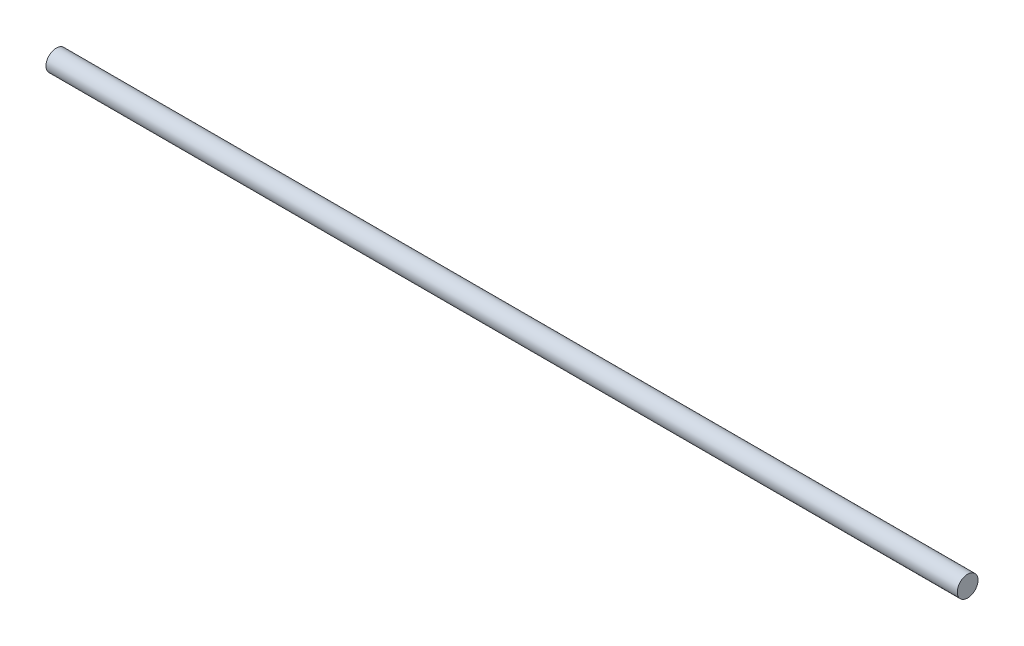
ISO-10303-21;
HEADER;
FILE_DESCRIPTION(('STEP AP214'),'2;1');
FILE_NAME('part.step','',(''),(''),'','','');
FILE_SCHEMA(('AUTOMOTIVE_DESIGN { 1 0 10303 214 1 1 1 1 }'));
ENDSEC;
DATA;
#1=APPLICATION_CONTEXT('core data for automotive mechanical design processes');
#2=APPLICATION_PROTOCOL_DEFINITION('international standard','automotive_design',2000,#1);
#3=PRODUCT_CONTEXT('',#1,'mechanical');
#4=PRODUCT('Part','Part','',(#3));
#5=PRODUCT_RELATED_PRODUCT_CATEGORY('part','',(#4));
#6=PRODUCT_DEFINITION_FORMATION('','',#4);
#7=PRODUCT_DEFINITION_CONTEXT('part definition',#1,'design');
#8=PRODUCT_DEFINITION('design','',#6,#7);
#9=PRODUCT_DEFINITION_SHAPE('','',#8);
#10=(LENGTH_UNIT() NAMED_UNIT(*) SI_UNIT(.MILLI.,.METRE.));
#11=(NAMED_UNIT(*) PLANE_ANGLE_UNIT() SI_UNIT($,.RADIAN.));
#12=(NAMED_UNIT(*) SI_UNIT($,.STERADIAN.) SOLID_ANGLE_UNIT());
#13=UNCERTAINTY_MEASURE_WITH_UNIT(LENGTH_MEASURE(1.E-05),#10,'distance_accuracy_value','');
#14=(GEOMETRIC_REPRESENTATION_CONTEXT(3) GLOBAL_UNCERTAINTY_ASSIGNED_CONTEXT((#13)) GLOBAL_UNIT_ASSIGNED_CONTEXT((#10,
#11,#12)) REPRESENTATION_CONTEXT('',''));
#15=CARTESIAN_POINT('',(0.,0.,0.));
#16=DIRECTION('',(0.,0.,1.));
#17=DIRECTION('',(1.,0.,0.));
#18=AXIS2_PLACEMENT_3D('',#15,#16,#17);
#19=CARTESIAN_POINT('',(220.,0.,0.));
#20=DIRECTION('',(-1.,0.,0.));
#21=DIRECTION('',(0.,0.,1.));
#22=AXIS2_PLACEMENT_3D('',#19,#20,#21);
#23=CYLINDRICAL_SURFACE('',#22,2.5);
#24=CARTESIAN_POINT('',(220.,0.,0.));
#25=DIRECTION('',(1.,0.,0.));
#26=DIRECTION('',(0.,0.,-1.));
#27=AXIS2_PLACEMENT_3D('',#24,#25,#26);
#28=CIRCLE('',#27,2.5);
#29=CARTESIAN_POINT('',(220.,0.,-2.5));
#30=VERTEX_POINT('',#29);
#31=EDGE_CURVE('E10',#30,#30,#28,.T.);
#32=ORIENTED_EDGE('',*,*,#31,.F.);
#33=EDGE_LOOP('',(#32));
#34=FACE_BOUND('',#33,.T.);
#35=CARTESIAN_POINT('',(0.,0.,0.));
#36=DIRECTION('',(1.,0.,0.));
#37=DIRECTION('',(0.,0.,-1.));
#38=AXIS2_PLACEMENT_3D('',#35,#36,#37);
#39=CIRCLE('',#38,2.5);
#40=CARTESIAN_POINT('',(0.,0.,-2.5));
#41=VERTEX_POINT('',#40);
#42=EDGE_CURVE('E34',#41,#41,#39,.T.);
#43=ORIENTED_EDGE('',*,*,#42,.T.);
#44=EDGE_LOOP('',(#43));
#45=FACE_BOUND('',#44,.T.);
#46=ADVANCED_FACE('F31',(#34,#45),#23,.T.);
#47=CARTESIAN_POINT('',(220.,0.,0.));
#48=DIRECTION('',(1.,0.,0.));
#49=DIRECTION('',(0.,0.,-1.));
#50=AXIS2_PLACEMENT_3D('',#47,#48,#49);
#51=PLANE('',#50);
#52=ORIENTED_EDGE('',*,*,#31,.T.);
#53=EDGE_LOOP('',(#52));
#54=FACE_BOUND('',#53,.T.);
#55=ADVANCED_FACE('F46',(#54),#51,.T.);
#56=CARTESIAN_POINT('',(0.,0.,0.));
#57=DIRECTION('',(1.,0.,0.));
#58=DIRECTION('',(0.,0.,-1.));
#59=AXIS2_PLACEMENT_3D('',#56,#57,#58);
#60=PLANE('',#59);
#61=ORIENTED_EDGE('',*,*,#42,.F.);
#62=EDGE_LOOP('',(#61));
#63=FACE_BOUND('',#62,.T.);
#64=ADVANCED_FACE('F44',(#63),#60,.F.);
#65=CLOSED_SHELL('',(#46,#55,#64));
#66=MANIFOLD_SOLID_BREP('B2',#65);
#67=ADVANCED_BREP_SHAPE_REPRESENTATION('',(#18,#66),#14);
#68=SHAPE_DEFINITION_REPRESENTATION(#9,#67);
ENDSEC;
END-ISO-10303-21;
